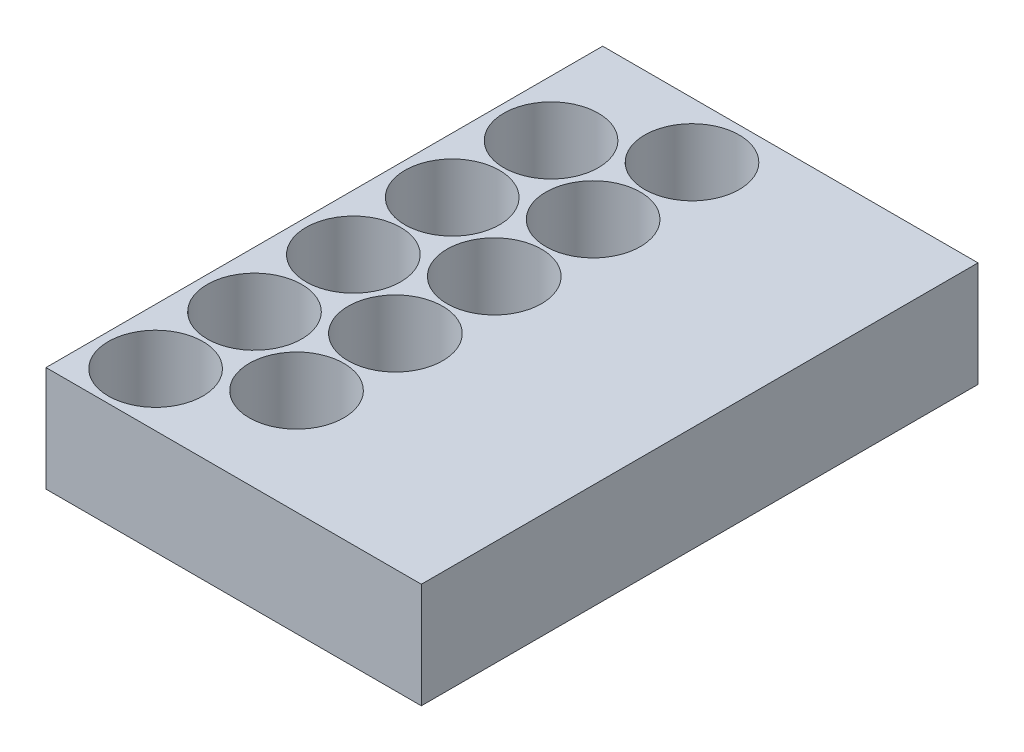
ISO-10303-21;
HEADER;
FILE_DESCRIPTION(('STEP AP214'),'2;1');
FILE_NAME('part.step','',(''),(''),'','','');
FILE_SCHEMA(('AUTOMOTIVE_DESIGN { 1 0 10303 214 1 1 1 1 }'));
ENDSEC;
DATA;
#1=APPLICATION_CONTEXT('core data for automotive mechanical design processes');
#2=APPLICATION_PROTOCOL_DEFINITION('international standard','automotive_design',2000,#1);
#3=PRODUCT_CONTEXT('',#1,'mechanical');
#4=PRODUCT('Part','Part','',(#3));
#5=PRODUCT_RELATED_PRODUCT_CATEGORY('part','',(#4));
#6=PRODUCT_DEFINITION_FORMATION('','',#4);
#7=PRODUCT_DEFINITION_CONTEXT('part definition',#1,'design');
#8=PRODUCT_DEFINITION('design','',#6,#7);
#9=PRODUCT_DEFINITION_SHAPE('','',#8);
#10=(LENGTH_UNIT() NAMED_UNIT(*) SI_UNIT(.MILLI.,.METRE.));
#11=(NAMED_UNIT(*) PLANE_ANGLE_UNIT() SI_UNIT($,.RADIAN.));
#12=(NAMED_UNIT(*) SI_UNIT($,.STERADIAN.) SOLID_ANGLE_UNIT());
#13=UNCERTAINTY_MEASURE_WITH_UNIT(LENGTH_MEASURE(1.E-05),#10,'distance_accuracy_value','');
#14=(GEOMETRIC_REPRESENTATION_CONTEXT(3) GLOBAL_UNCERTAINTY_ASSIGNED_CONTEXT((#13)) GLOBAL_UNIT_ASSIGNED_CONTEXT((#10,
#11,#12)) REPRESENTATION_CONTEXT('',''));
#15=CARTESIAN_POINT('',(0.,0.,0.));
#16=DIRECTION('',(0.,0.,1.));
#17=DIRECTION('',(1.,0.,0.));
#18=AXIS2_PLACEMENT_3D('',#15,#16,#17);
#19=CARTESIAN_POINT('',(-9.87539030917345,0.,40.25));
#20=DIRECTION('',(0.,1.,0.));
#21=DIRECTION('',(0.,0.,1.));
#22=AXIS2_PLACEMENT_3D('',#19,#20,#21);
#23=CYLINDRICAL_SURFACE('',#22,11.);
#24=CARTESIAN_POINT('',(-9.87539030917345,0.,40.25));
#25=DIRECTION('',(0.,1.,0.));
#26=DIRECTION('',(0.,0.,1.));
#27=AXIS2_PLACEMENT_3D('',#24,#25,#26);
#28=CIRCLE('',#27,11.);
#29=CARTESIAN_POINT('',(-9.87539030917345,0.,51.25));
#30=VERTEX_POINT('',#29);
#31=EDGE_CURVE('E88',#30,#30,#28,.T.);
#32=ORIENTED_EDGE('',*,*,#31,.F.);
#33=EDGE_LOOP('',(#32));
#34=FACE_BOUND('',#33,.T.);
#35=CARTESIAN_POINT('',(-9.87539030917345,24.5,40.25));
#36=DIRECTION('',(0.,1.,0.));
#37=DIRECTION('',(0.,0.,1.));
#38=AXIS2_PLACEMENT_3D('',#35,#36,#37);
#39=CIRCLE('',#38,11.);
#40=CARTESIAN_POINT('',(-9.87539030917345,24.5,51.25));
#41=VERTEX_POINT('',#40);
#42=EDGE_CURVE('E12',#41,#41,#39,.T.);
#43=ORIENTED_EDGE('',*,*,#42,.T.);
#44=EDGE_LOOP('',(#43));
#45=FACE_BOUND('',#44,.T.);
#46=ADVANCED_FACE('F79',(#34,#45),#23,.F.);
#47=CARTESIAN_POINT('',(-30.66,0.,52.2499999999999));
#48=DIRECTION('',(0.,1.,0.));
#49=DIRECTION('',(0.,0.,1.));
#50=AXIS2_PLACEMENT_3D('',#47,#48,#49);
#51=CYLINDRICAL_SURFACE('',#50,11.);
#52=CARTESIAN_POINT('',(-30.66,0.,52.2499999999999));
#53=DIRECTION('',(0.,1.,0.));
#54=DIRECTION('',(0.,0.,1.));
#55=AXIS2_PLACEMENT_3D('',#52,#53,#54);
#56=CIRCLE('',#55,11.);
#57=CARTESIAN_POINT('',(-30.66,0.,63.2499999999999));
#58=VERTEX_POINT('',#57);
#59=EDGE_CURVE('E216',#58,#58,#56,.T.);
#60=ORIENTED_EDGE('',*,*,#59,.F.);
#61=EDGE_LOOP('',(#60));
#62=FACE_BOUND('',#61,.T.);
#63=CARTESIAN_POINT('',(-30.66,24.5,52.2499999999999));
#64=DIRECTION('',(0.,1.,0.));
#65=DIRECTION('',(0.,0.,1.));
#66=AXIS2_PLACEMENT_3D('',#63,#64,#65);
#67=CIRCLE('',#66,11.);
#68=CARTESIAN_POINT('',(-30.66,24.5,63.2499999999999));
#69=VERTEX_POINT('',#68);
#70=EDGE_CURVE('E220',#69,#69,#67,.T.);
#71=ORIENTED_EDGE('',*,*,#70,.T.);
#72=EDGE_LOOP('',(#71));
#73=FACE_BOUND('',#72,.T.);
#74=ADVANCED_FACE('F232',(#62,#73),#51,.F.);
#75=CARTESIAN_POINT('',(-9.87539030917345,0.,17.25));
#76=DIRECTION('',(0.,1.,0.));
#77=DIRECTION('',(0.,0.,1.));
#78=AXIS2_PLACEMENT_3D('',#75,#76,#77);
#79=CYLINDRICAL_SURFACE('',#78,11.);
#80=CARTESIAN_POINT('',(-9.87539030917345,0.,17.25));
#81=DIRECTION('',(0.,1.,0.));
#82=DIRECTION('',(0.,0.,1.));
#83=AXIS2_PLACEMENT_3D('',#80,#81,#82);
#84=CIRCLE('',#83,11.);
#85=CARTESIAN_POINT('',(-9.87539030917345,0.,28.25));
#86=VERTEX_POINT('',#85);
#87=EDGE_CURVE('E208',#86,#86,#84,.T.);
#88=ORIENTED_EDGE('',*,*,#87,.F.);
#89=EDGE_LOOP('',(#88));
#90=FACE_BOUND('',#89,.T.);
#91=CARTESIAN_POINT('',(-9.87539030917345,24.5,17.25));
#92=DIRECTION('',(0.,1.,0.));
#93=DIRECTION('',(0.,0.,1.));
#94=AXIS2_PLACEMENT_3D('',#91,#92,#93);
#95=CIRCLE('',#94,11.);
#96=CARTESIAN_POINT('',(-9.87539030917345,24.5,28.25));
#97=VERTEX_POINT('',#96);
#98=EDGE_CURVE('E212',#97,#97,#95,.T.);
#99=ORIENTED_EDGE('',*,*,#98,.T.);
#100=EDGE_LOOP('',(#99));
#101=FACE_BOUND('',#100,.T.);
#102=ADVANCED_FACE('F319',(#90,#101),#79,.F.);
#103=CARTESIAN_POINT('',(-30.66,0.,29.25));
#104=DIRECTION('',(0.,1.,0.));
#105=DIRECTION('',(0.,0.,1.));
#106=AXIS2_PLACEMENT_3D('',#103,#104,#105);
#107=CYLINDRICAL_SURFACE('',#106,11.);
#108=CARTESIAN_POINT('',(-30.66,0.,29.25));
#109=DIRECTION('',(0.,1.,0.));
#110=DIRECTION('',(0.,0.,1.));
#111=AXIS2_PLACEMENT_3D('',#108,#109,#110);
#112=CIRCLE('',#111,11.);
#113=CARTESIAN_POINT('',(-30.66,0.,40.25));
#114=VERTEX_POINT('',#113);
#115=EDGE_CURVE('E200',#114,#114,#112,.T.);
#116=ORIENTED_EDGE('',*,*,#115,.F.);
#117=EDGE_LOOP('',(#116));
#118=FACE_BOUND('',#117,.T.);
#119=CARTESIAN_POINT('',(-30.66,24.5,29.25));
#120=DIRECTION('',(0.,1.,0.));
#121=DIRECTION('',(0.,0.,1.));
#122=AXIS2_PLACEMENT_3D('',#119,#120,#121);
#123=CIRCLE('',#122,11.);
#124=CARTESIAN_POINT('',(-30.66,24.5,40.25));
#125=VERTEX_POINT('',#124);
#126=EDGE_CURVE('E204',#125,#125,#123,.T.);
#127=ORIENTED_EDGE('',*,*,#126,.T.);
#128=EDGE_LOOP('',(#127));
#129=FACE_BOUND('',#128,.T.);
#130=ADVANCED_FACE('F315',(#118,#129),#107,.F.);
#131=CARTESIAN_POINT('',(-9.87539030917345,0.,-5.75000000000001));
#132=DIRECTION('',(0.,1.,0.));
#133=DIRECTION('',(0.,0.,1.));
#134=AXIS2_PLACEMENT_3D('',#131,#132,#133);
#135=CYLINDRICAL_SURFACE('',#134,11.);
#136=CARTESIAN_POINT('',(-9.87539030917345,0.,-5.75000000000001));
#137=DIRECTION('',(0.,1.,0.));
#138=DIRECTION('',(0.,0.,1.));
#139=AXIS2_PLACEMENT_3D('',#136,#137,#138);
#140=CIRCLE('',#139,11.);
#141=CARTESIAN_POINT('',(-9.87539030917345,0.,5.24999999999999));
#142=VERTEX_POINT('',#141);
#143=EDGE_CURVE('E192',#142,#142,#140,.T.);
#144=ORIENTED_EDGE('',*,*,#143,.F.);
#145=EDGE_LOOP('',(#144));
#146=FACE_BOUND('',#145,.T.);
#147=CARTESIAN_POINT('',(-9.87539030917345,24.5,-5.75000000000001));
#148=DIRECTION('',(0.,1.,0.));
#149=DIRECTION('',(0.,0.,1.));
#150=AXIS2_PLACEMENT_3D('',#147,#148,#149);
#151=CIRCLE('',#150,11.);
#152=CARTESIAN_POINT('',(-9.87539030917345,24.5,5.24999999999999));
#153=VERTEX_POINT('',#152);
#154=EDGE_CURVE('E196',#153,#153,#151,.T.);
#155=ORIENTED_EDGE('',*,*,#154,.T.);
#156=EDGE_LOOP('',(#155));
#157=FACE_BOUND('',#156,.T.);
#158=ADVANCED_FACE('F311',(#146,#157),#135,.F.);
#159=CARTESIAN_POINT('',(-30.66,0.,6.24999999999994));
#160=DIRECTION('',(0.,1.,0.));
#161=DIRECTION('',(0.,0.,1.));
#162=AXIS2_PLACEMENT_3D('',#159,#160,#161);
#163=CYLINDRICAL_SURFACE('',#162,11.);
#164=CARTESIAN_POINT('',(-30.66,0.,6.24999999999994));
#165=DIRECTION('',(0.,1.,0.));
#166=DIRECTION('',(0.,0.,1.));
#167=AXIS2_PLACEMENT_3D('',#164,#165,#166);
#168=CIRCLE('',#167,11.);
#169=CARTESIAN_POINT('',(-30.66,0.,17.2499999999999));
#170=VERTEX_POINT('',#169);
#171=EDGE_CURVE('E184',#170,#170,#168,.T.);
#172=ORIENTED_EDGE('',*,*,#171,.F.);
#173=EDGE_LOOP('',(#172));
#174=FACE_BOUND('',#173,.T.);
#175=CARTESIAN_POINT('',(-30.66,24.5,6.24999999999994));
#176=DIRECTION('',(0.,1.,0.));
#177=DIRECTION('',(0.,0.,1.));
#178=AXIS2_PLACEMENT_3D('',#175,#176,#177);
#179=CIRCLE('',#178,11.);
#180=CARTESIAN_POINT('',(-30.66,24.5,17.2499999999999));
#181=VERTEX_POINT('',#180);
#182=EDGE_CURVE('E188',#181,#181,#179,.T.);
#183=ORIENTED_EDGE('',*,*,#182,.T.);
#184=EDGE_LOOP('',(#183));
#185=FACE_BOUND('',#184,.T.);
#186=ADVANCED_FACE('F307',(#174,#185),#163,.F.);
#187=CARTESIAN_POINT('',(-9.87539030917345,0.,-28.75));
#188=DIRECTION('',(0.,1.,0.));
#189=DIRECTION('',(0.,0.,1.));
#190=AXIS2_PLACEMENT_3D('',#187,#188,#189);
#191=CYLINDRICAL_SURFACE('',#190,11.);
#192=CARTESIAN_POINT('',(-9.87539030917345,0.,-28.75));
#193=DIRECTION('',(0.,1.,0.));
#194=DIRECTION('',(0.,0.,1.));
#195=AXIS2_PLACEMENT_3D('',#192,#193,#194);
#196=CIRCLE('',#195,11.);
#197=CARTESIAN_POINT('',(-9.87539030917345,0.,-17.75));
#198=VERTEX_POINT('',#197);
#199=EDGE_CURVE('E176',#198,#198,#196,.T.);
#200=ORIENTED_EDGE('',*,*,#199,.F.);
#201=EDGE_LOOP('',(#200));
#202=FACE_BOUND('',#201,.T.);
#203=CARTESIAN_POINT('',(-9.87539030917345,24.5,-28.75));
#204=DIRECTION('',(0.,1.,0.));
#205=DIRECTION('',(0.,0.,1.));
#206=AXIS2_PLACEMENT_3D('',#203,#204,#205);
#207=CIRCLE('',#206,11.);
#208=CARTESIAN_POINT('',(-9.87539030917345,24.5,-17.75));
#209=VERTEX_POINT('',#208);
#210=EDGE_CURVE('E180',#209,#209,#207,.T.);
#211=ORIENTED_EDGE('',*,*,#210,.T.);
#212=EDGE_LOOP('',(#211));
#213=FACE_BOUND('',#212,.T.);
#214=ADVANCED_FACE('F303',(#202,#213),#191,.F.);
#215=CARTESIAN_POINT('',(-30.66,0.,-16.7500000000001));
#216=DIRECTION('',(0.,1.,0.));
#217=DIRECTION('',(0.,0.,1.));
#218=AXIS2_PLACEMENT_3D('',#215,#216,#217);
#219=CYLINDRICAL_SURFACE('',#218,11.);
#220=CARTESIAN_POINT('',(-30.66,0.,-16.7500000000001));
#221=DIRECTION('',(0.,1.,0.));
#222=DIRECTION('',(0.,0.,1.));
#223=AXIS2_PLACEMENT_3D('',#220,#221,#222);
#224=CIRCLE('',#223,11.);
#225=CARTESIAN_POINT('',(-30.66,0.,-5.75000000000006));
#226=VERTEX_POINT('',#225);
#227=EDGE_CURVE('E168',#226,#226,#224,.T.);
#228=ORIENTED_EDGE('',*,*,#227,.F.);
#229=EDGE_LOOP('',(#228));
#230=FACE_BOUND('',#229,.T.);
#231=CARTESIAN_POINT('',(-30.66,24.5,-16.7500000000001));
#232=DIRECTION('',(0.,1.,0.));
#233=DIRECTION('',(0.,0.,1.));
#234=AXIS2_PLACEMENT_3D('',#231,#232,#233);
#235=CIRCLE('',#234,11.);
#236=CARTESIAN_POINT('',(-30.66,24.5,-5.75000000000006));
#237=VERTEX_POINT('',#236);
#238=EDGE_CURVE('E172',#237,#237,#235,.T.);
#239=ORIENTED_EDGE('',*,*,#238,.T.);
#240=EDGE_LOOP('',(#239));
#241=FACE_BOUND('',#240,.T.);
#242=ADVANCED_FACE('F299',(#230,#241),#219,.F.);
#243=CARTESIAN_POINT('',(43.66,24.5,64.75));
#244=DIRECTION('',(-1.,0.,0.));
#245=DIRECTION('',(0.,0.,1.));
#246=AXIS2_PLACEMENT_3D('',#243,#244,#245);
#247=PLANE('',#246);
#248=DIRECTION('',(0.,0.,-1.));
#249=VECTOR('',#248,1.);
#250=CARTESIAN_POINT('',(43.66,0.,64.75));
#251=LINE('',#250,#249);
#252=CARTESIAN_POINT('',(43.66,0.,64.75));
#253=VERTEX_POINT('',#252);
#254=CARTESIAN_POINT('',(43.66,0.,-64.75));
#255=VERTEX_POINT('',#254);
#256=EDGE_CURVE('E151',#253,#255,#251,.T.);
#257=ORIENTED_EDGE('',*,*,#256,.T.);
#258=DIRECTION('',(0.,-1.,0.));
#259=VECTOR('',#258,1.);
#260=CARTESIAN_POINT('',(43.66,24.5,-64.75));
#261=LINE('',#260,#259);
#262=CARTESIAN_POINT('',(43.66,24.5,-64.75));
#263=VERTEX_POINT('',#262);
#264=EDGE_CURVE('E140',#263,#255,#261,.T.);
#265=ORIENTED_EDGE('',*,*,#264,.F.);
#266=DIRECTION('',(0.,0.,-1.));
#267=VECTOR('',#266,1.);
#268=CARTESIAN_POINT('',(43.66,24.5,64.75));
#269=LINE('',#268,#267);
#270=CARTESIAN_POINT('',(43.66,24.5,64.75));
#271=VERTEX_POINT('',#270);
#272=EDGE_CURVE('E132',#271,#263,#269,.T.);
#273=ORIENTED_EDGE('',*,*,#272,.F.);
#274=DIRECTION('',(0.,-1.,0.));
#275=VECTOR('',#274,1.);
#276=CARTESIAN_POINT('',(43.66,24.5,64.75));
#277=LINE('',#276,#275);
#278=EDGE_CURVE('E147',#271,#253,#277,.T.);
#279=ORIENTED_EDGE('',*,*,#278,.T.);
#280=EDGE_LOOP('',(#257,#265,#273,#279));
#281=FACE_BOUND('',#280,.T.);
#282=ADVANCED_FACE('F296',(#281),#247,.F.);
#283=CARTESIAN_POINT('',(-43.66,24.5,-64.75));
#284=DIRECTION('',(0.,0.,1.));
#285=DIRECTION('',(1.,0.,0.));
#286=AXIS2_PLACEMENT_3D('',#283,#284,#285);
#287=PLANE('',#286);
#288=DIRECTION('',(-1.,0.,0.));
#289=VECTOR('',#288,1.);
#290=CARTESIAN_POINT('',(-43.66,0.,-64.75));
#291=LINE('',#290,#289);
#292=CARTESIAN_POINT('',(-43.66,0.,-64.75));
#293=VERTEX_POINT('',#292);
#294=EDGE_CURVE('E138',#255,#293,#291,.T.);
#295=ORIENTED_EDGE('',*,*,#294,.T.);
#296=DIRECTION('',(0.,-1.,0.));
#297=VECTOR('',#296,1.);
#298=CARTESIAN_POINT('',(-43.66,24.5,-64.75));
#299=LINE('',#298,#297);
#300=CARTESIAN_POINT('',(-43.66,24.5,-64.75));
#301=VERTEX_POINT('',#300);
#302=EDGE_CURVE('E136',#301,#293,#299,.T.);
#303=ORIENTED_EDGE('',*,*,#302,.F.);
#304=DIRECTION('',(-1.,0.,0.));
#305=VECTOR('',#304,1.);
#306=CARTESIAN_POINT('',(-43.66,24.5,-64.75));
#307=LINE('',#306,#305);
#308=EDGE_CURVE('E127',#263,#301,#307,.T.);
#309=ORIENTED_EDGE('',*,*,#308,.F.);
#310=ORIENTED_EDGE('',*,*,#264,.T.);
#311=EDGE_LOOP('',(#295,#303,#309,#310));
#312=FACE_BOUND('',#311,.T.);
#313=ADVANCED_FACE('F137',(#312),#287,.F.);
#314=CARTESIAN_POINT('',(-43.66,24.5,64.75));
#315=DIRECTION('',(1.,0.,0.));
#316=DIRECTION('',(0.,0.,-1.));
#317=AXIS2_PLACEMENT_3D('',#314,#315,#316);
#318=PLANE('',#317);
#319=DIRECTION('',(0.,0.,1.));
#320=VECTOR('',#319,1.);
#321=CARTESIAN_POINT('',(-43.66,0.,64.75));
#322=LINE('',#321,#320);
#323=CARTESIAN_POINT('',(-43.66,0.,64.75));
#324=VERTEX_POINT('',#323);
#325=EDGE_CURVE('E113',#293,#324,#322,.T.);
#326=ORIENTED_EDGE('',*,*,#325,.T.);
#327=DIRECTION('',(0.,-1.,0.));
#328=VECTOR('',#327,1.);
#329=CARTESIAN_POINT('',(-43.66,24.5,64.75));
#330=LINE('',#329,#328);
#331=CARTESIAN_POINT('',(-43.66,24.5,64.75));
#332=VERTEX_POINT('',#331);
#333=EDGE_CURVE('E141',#332,#324,#330,.T.);
#334=ORIENTED_EDGE('',*,*,#333,.F.);
#335=DIRECTION('',(0.,0.,1.));
#336=VECTOR('',#335,1.);
#337=CARTESIAN_POINT('',(-43.66,24.5,64.75));
#338=LINE('',#337,#336);
#339=EDGE_CURVE('E130',#301,#332,#338,.T.);
#340=ORIENTED_EDGE('',*,*,#339,.F.);
#341=ORIENTED_EDGE('',*,*,#302,.T.);
#342=EDGE_LOOP('',(#326,#334,#340,#341));
#343=FACE_BOUND('',#342,.T.);
#344=ADVANCED_FACE('F143',(#343),#318,.F.);
#345=CARTESIAN_POINT('',(-43.66,24.5,64.75));
#346=DIRECTION('',(0.,0.,-1.));
#347=DIRECTION('',(-1.,0.,0.));
#348=AXIS2_PLACEMENT_3D('',#345,#346,#347);
#349=PLANE('',#348);
#350=DIRECTION('',(1.,0.,0.));
#351=VECTOR('',#350,1.);
#352=CARTESIAN_POINT('',(-43.66,0.,64.75));
#353=LINE('',#352,#351);
#354=EDGE_CURVE('E119',#324,#253,#353,.T.);
#355=ORIENTED_EDGE('',*,*,#354,.T.);
#356=ORIENTED_EDGE('',*,*,#278,.F.);
#357=DIRECTION('',(1.,0.,0.));
#358=VECTOR('',#357,1.);
#359=CARTESIAN_POINT('',(-43.66,24.5,64.75));
#360=LINE('',#359,#358);
#361=EDGE_CURVE('E96',#332,#271,#360,.T.);
#362=ORIENTED_EDGE('',*,*,#361,.F.);
#363=ORIENTED_EDGE('',*,*,#333,.T.);
#364=EDGE_LOOP('',(#355,#356,#362,#363));
#365=FACE_BOUND('',#364,.T.);
#366=ADVANCED_FACE('F237',(#365),#349,.F.);
#367=CARTESIAN_POINT('',(0.,24.5,0.));
#368=DIRECTION('',(0.,-1.,0.));
#369=DIRECTION('',(0.,0.,-1.));
#370=AXIS2_PLACEMENT_3D('',#367,#368,#369);
#371=PLANE('',#370);
#372=ORIENTED_EDGE('',*,*,#70,.F.);
#373=EDGE_LOOP('',(#372));
#374=FACE_BOUND('',#373,.T.);
#375=ORIENTED_EDGE('',*,*,#42,.F.);
#376=EDGE_LOOP('',(#375));
#377=FACE_BOUND('',#376,.T.);
#378=ORIENTED_EDGE('',*,*,#126,.F.);
#379=EDGE_LOOP('',(#378));
#380=FACE_BOUND('',#379,.T.);
#381=ORIENTED_EDGE('',*,*,#98,.F.);
#382=EDGE_LOOP('',(#381));
#383=FACE_BOUND('',#382,.T.);
#384=ORIENTED_EDGE('',*,*,#182,.F.);
#385=EDGE_LOOP('',(#384));
#386=FACE_BOUND('',#385,.T.);
#387=ORIENTED_EDGE('',*,*,#154,.F.);
#388=EDGE_LOOP('',(#387));
#389=FACE_BOUND('',#388,.T.);
#390=ORIENTED_EDGE('',*,*,#238,.F.);
#391=EDGE_LOOP('',(#390));
#392=FACE_BOUND('',#391,.T.);
#393=ORIENTED_EDGE('',*,*,#210,.F.);
#394=EDGE_LOOP('',(#393));
#395=FACE_BOUND('',#394,.T.);
#396=CARTESIAN_POINT('',(-9.87539030917345,24.5,-51.75));
#397=DIRECTION('',(0.,1.,0.));
#398=DIRECTION('',(0.,0.,1.));
#399=AXIS2_PLACEMENT_3D('',#396,#397,#398);
#400=CIRCLE('',#399,11.);
#401=CARTESIAN_POINT('',(-9.87539030917345,24.5,-40.75));
#402=VERTEX_POINT('',#401);
#403=EDGE_CURVE('E255',#402,#402,#400,.T.);
#404=ORIENTED_EDGE('',*,*,#403,.F.);
#405=EDGE_LOOP('',(#404));
#406=FACE_BOUND('',#405,.T.);
#407=CARTESIAN_POINT('',(-30.66,24.5,-39.7500000000001));
#408=DIRECTION('',(0.,1.,0.));
#409=DIRECTION('',(0.,0.,1.));
#410=AXIS2_PLACEMENT_3D('',#407,#408,#409);
#411=CIRCLE('',#410,11.);
#412=CARTESIAN_POINT('',(-30.66,24.5,-28.7500000000001));
#413=VERTEX_POINT('',#412);
#414=EDGE_CURVE('E258',#413,#413,#411,.T.);
#415=ORIENTED_EDGE('',*,*,#414,.F.);
#416=EDGE_LOOP('',(#415));
#417=FACE_BOUND('',#416,.T.);
#418=ORIENTED_EDGE('',*,*,#272,.T.);
#419=ORIENTED_EDGE('',*,*,#308,.T.);
#420=ORIENTED_EDGE('',*,*,#339,.T.);
#421=ORIENTED_EDGE('',*,*,#361,.T.);
#422=EDGE_LOOP('',(#418,#419,#420,#421));
#423=FACE_BOUND('',#422,.T.);
#424=ADVANCED_FACE('F128',(#374,#377,#380,#383,#386,#389,#392,#395,#406,#417,#423),#371,.F.);
#425=CARTESIAN_POINT('',(0.,0.,0.));
#426=DIRECTION('',(0.,-1.,0.));
#427=DIRECTION('',(0.,0.,-1.));
#428=AXIS2_PLACEMENT_3D('',#425,#426,#427);
#429=PLANE('',#428);
#430=ORIENTED_EDGE('',*,*,#59,.T.);
#431=EDGE_LOOP('',(#430));
#432=FACE_BOUND('',#431,.T.);
#433=ORIENTED_EDGE('',*,*,#31,.T.);
#434=EDGE_LOOP('',(#433));
#435=FACE_BOUND('',#434,.T.);
#436=ORIENTED_EDGE('',*,*,#115,.T.);
#437=EDGE_LOOP('',(#436));
#438=FACE_BOUND('',#437,.T.);
#439=ORIENTED_EDGE('',*,*,#87,.T.);
#440=EDGE_LOOP('',(#439));
#441=FACE_BOUND('',#440,.T.);
#442=ORIENTED_EDGE('',*,*,#171,.T.);
#443=EDGE_LOOP('',(#442));
#444=FACE_BOUND('',#443,.T.);
#445=ORIENTED_EDGE('',*,*,#143,.T.);
#446=EDGE_LOOP('',(#445));
#447=FACE_BOUND('',#446,.T.);
#448=ORIENTED_EDGE('',*,*,#227,.T.);
#449=EDGE_LOOP('',(#448));
#450=FACE_BOUND('',#449,.T.);
#451=ORIENTED_EDGE('',*,*,#199,.T.);
#452=EDGE_LOOP('',(#451));
#453=FACE_BOUND('',#452,.T.);
#454=CARTESIAN_POINT('',(-9.87539030917345,0.,-51.75));
#455=DIRECTION('',(0.,1.,0.));
#456=DIRECTION('',(0.,0.,1.));
#457=AXIS2_PLACEMENT_3D('',#454,#455,#456);
#458=CIRCLE('',#457,11.);
#459=CARTESIAN_POINT('',(-9.87539030917345,0.,-40.75));
#460=VERTEX_POINT('',#459);
#461=EDGE_CURVE('E266',#460,#460,#458,.T.);
#462=ORIENTED_EDGE('',*,*,#461,.T.);
#463=EDGE_LOOP('',(#462));
#464=FACE_BOUND('',#463,.T.);
#465=CARTESIAN_POINT('',(-30.66,0.,-39.7500000000001));
#466=DIRECTION('',(0.,1.,0.));
#467=DIRECTION('',(0.,0.,1.));
#468=AXIS2_PLACEMENT_3D('',#465,#466,#467);
#469=CIRCLE('',#468,11.);
#470=CARTESIAN_POINT('',(-30.66,0.,-28.7500000000001));
#471=VERTEX_POINT('',#470);
#472=EDGE_CURVE('E155',#471,#471,#469,.T.);
#473=ORIENTED_EDGE('',*,*,#472,.T.);
#474=EDGE_LOOP('',(#473));
#475=FACE_BOUND('',#474,.T.);
#476=ORIENTED_EDGE('',*,*,#256,.F.);
#477=ORIENTED_EDGE('',*,*,#354,.F.);
#478=ORIENTED_EDGE('',*,*,#325,.F.);
#479=ORIENTED_EDGE('',*,*,#294,.F.);
#480=EDGE_LOOP('',(#476,#477,#478,#479));
#481=FACE_BOUND('',#480,.T.);
#482=ADVANCED_FACE('F227',(#432,#435,#438,#441,#444,#447,#450,#453,#464,#475,#481),#429,.T.);
#483=CARTESIAN_POINT('',(-30.66,0.,-39.7500000000001));
#484=DIRECTION('',(0.,1.,0.));
#485=DIRECTION('',(0.,0.,1.));
#486=AXIS2_PLACEMENT_3D('',#483,#484,#485);
#487=CYLINDRICAL_SURFACE('',#486,11.);
#488=ORIENTED_EDGE('',*,*,#472,.F.);
#489=EDGE_LOOP('',(#488));
#490=FACE_BOUND('',#489,.T.);
#491=ORIENTED_EDGE('',*,*,#414,.T.);
#492=EDGE_LOOP('',(#491));
#493=FACE_BOUND('',#492,.T.);
#494=ADVANCED_FACE('F279',(#490,#493),#487,.F.);
#495=CARTESIAN_POINT('',(-9.87539030917345,0.,-51.75));
#496=DIRECTION('',(0.,1.,0.));
#497=DIRECTION('',(0.,0.,1.));
#498=AXIS2_PLACEMENT_3D('',#495,#496,#497);
#499=CYLINDRICAL_SURFACE('',#498,11.);
#500=ORIENTED_EDGE('',*,*,#461,.F.);
#501=EDGE_LOOP('',(#500));
#502=FACE_BOUND('',#501,.T.);
#503=ORIENTED_EDGE('',*,*,#403,.T.);
#504=EDGE_LOOP('',(#503));
#505=FACE_BOUND('',#504,.T.);
#506=ADVANCED_FACE('F276',(#502,#505),#499,.F.);
#507=CLOSED_SHELL('',(#46,#74,#102,#130,#158,#186,#214,#242,#282,#313,#344,#366,#424,#482,#494,#506));
#508=MANIFOLD_SOLID_BREP('B2',#507);
#509=ADVANCED_BREP_SHAPE_REPRESENTATION('',(#18,#508),#14);
#510=SHAPE_DEFINITION_REPRESENTATION(#9,#509);
ENDSEC;
END-ISO-10303-21;
